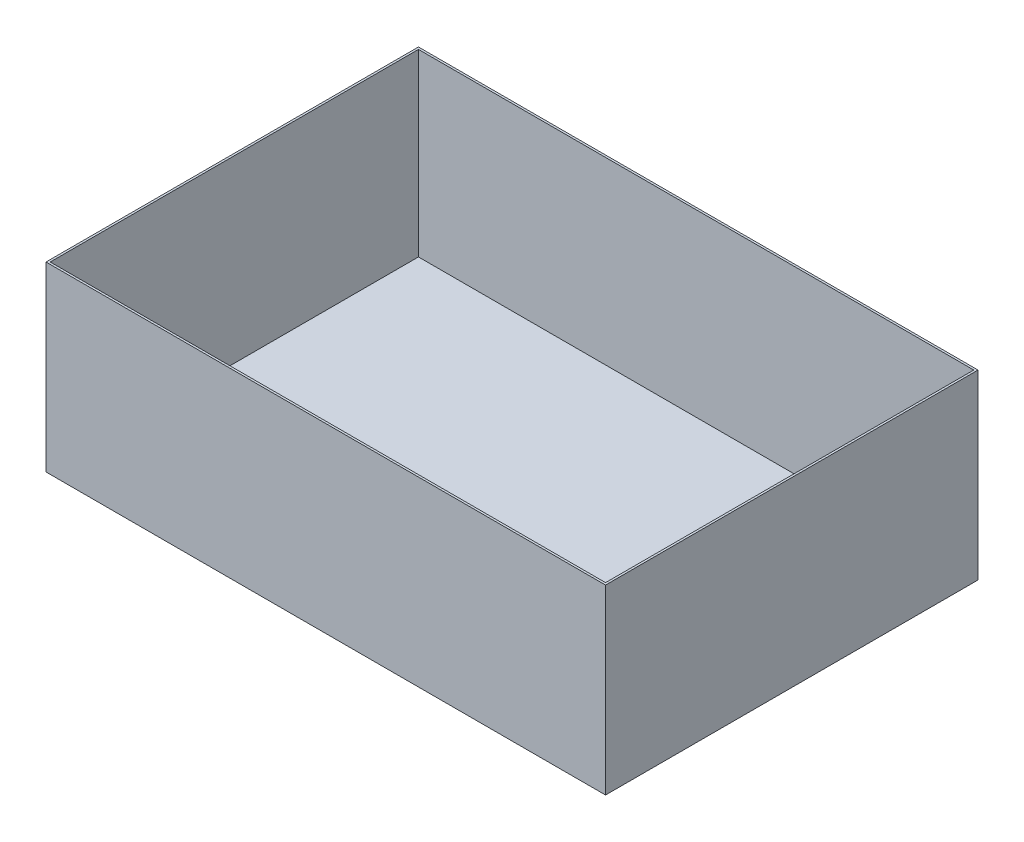
ISO-10303-21;
HEADER;
FILE_DESCRIPTION(('STEP AP214'),'2;1');
FILE_NAME('part.step','',(''),(''),'','','');
FILE_SCHEMA(('AUTOMOTIVE_DESIGN { 1 0 10303 214 1 1 1 1 }'));
ENDSEC;
DATA;
#1=APPLICATION_CONTEXT('core data for automotive mechanical design processes');
#2=APPLICATION_PROTOCOL_DEFINITION('international standard','automotive_design',2000,#1);
#3=PRODUCT_CONTEXT('',#1,'mechanical');
#4=PRODUCT('Part','Part','',(#3));
#5=PRODUCT_RELATED_PRODUCT_CATEGORY('part','',(#4));
#6=PRODUCT_DEFINITION_FORMATION('','',#4);
#7=PRODUCT_DEFINITION_CONTEXT('part definition',#1,'design');
#8=PRODUCT_DEFINITION('design','',#6,#7);
#9=PRODUCT_DEFINITION_SHAPE('','',#8);
#10=(LENGTH_UNIT() NAMED_UNIT(*) SI_UNIT(.MILLI.,.METRE.));
#11=(NAMED_UNIT(*) PLANE_ANGLE_UNIT() SI_UNIT($,.RADIAN.));
#12=(NAMED_UNIT(*) SI_UNIT($,.STERADIAN.) SOLID_ANGLE_UNIT());
#13=UNCERTAINTY_MEASURE_WITH_UNIT(LENGTH_MEASURE(1.E-05),#10,'distance_accuracy_value','');
#14=(GEOMETRIC_REPRESENTATION_CONTEXT(3) GLOBAL_UNCERTAINTY_ASSIGNED_CONTEXT((#13)) GLOBAL_UNIT_ASSIGNED_CONTEXT((#10,
#11,#12)) REPRESENTATION_CONTEXT('',''));
#15=CARTESIAN_POINT('',(0.,0.,0.));
#16=DIRECTION('',(0.,0.,1.));
#17=DIRECTION('',(1.,0.,0.));
#18=AXIS2_PLACEMENT_3D('',#15,#16,#17);
#19=CARTESIAN_POINT('',(0.,195.,0.));
#20=DIRECTION('',(0.,-1.,0.));
#21=DIRECTION('',(0.,0.,-1.));
#22=AXIS2_PLACEMENT_3D('',#19,#20,#21);
#23=PLANE('',#22);
#24=DIRECTION('',(0.,0.,1.));
#25=VECTOR('',#24,1.);
#26=CARTESIAN_POINT('',(0.,195.,0.));
#27=LINE('',#26,#25);
#28=CARTESIAN_POINT('',(0.,195.,-399.38));
#29=VERTEX_POINT('',#28);
#30=CARTESIAN_POINT('',(0.,195.,0.));
#31=VERTEX_POINT('',#30);
#32=EDGE_CURVE('E145',#29,#31,#27,.T.);
#33=ORIENTED_EDGE('',*,*,#32,.T.);
#34=DIRECTION('',(1.,0.,0.));
#35=VECTOR('',#34,1.);
#36=CARTESIAN_POINT('',(0.,195.,0.));
#37=LINE('',#36,#35);
#38=CARTESIAN_POINT('',(600.,195.,0.));
#39=VERTEX_POINT('',#38);
#40=EDGE_CURVE('E89',#31,#39,#37,.T.);
#41=ORIENTED_EDGE('',*,*,#40,.T.);
#42=DIRECTION('',(0.,0.,-1.));
#43=VECTOR('',#42,1.);
#44=CARTESIAN_POINT('',(600.,195.,0.));
#45=LINE('',#44,#43);
#46=CARTESIAN_POINT('',(600.,195.,-399.38));
#47=VERTEX_POINT('',#46);
#48=EDGE_CURVE('E148',#39,#47,#45,.T.);
#49=ORIENTED_EDGE('',*,*,#48,.T.);
#50=DIRECTION('',(-1.,0.,0.));
#51=VECTOR('',#50,1.);
#52=CARTESIAN_POINT('',(0.,195.,-399.38));
#53=LINE('',#52,#51);
#54=EDGE_CURVE('E61',#47,#29,#53,.T.);
#55=ORIENTED_EDGE('',*,*,#54,.T.);
#56=EDGE_LOOP('',(#33,#41,#49,#55));
#57=FACE_BOUND('',#56,.T.);
#58=DIRECTION('',(0.,0.,1.));
#59=VECTOR('',#58,1.);
#60=CARTESIAN_POINT('',(2.25,195.,0.));
#61=LINE('',#60,#59);
#62=CARTESIAN_POINT('',(2.25,195.,-397.13));
#63=VERTEX_POINT('',#62);
#64=CARTESIAN_POINT('',(2.25,195.,-2.25));
#65=VERTEX_POINT('',#64);
#66=EDGE_CURVE('E134',#63,#65,#61,.T.);
#67=ORIENTED_EDGE('',*,*,#66,.F.);
#68=DIRECTION('',(-1.,0.,0.));
#69=VECTOR('',#68,1.);
#70=CARTESIAN_POINT('',(0.,195.,-397.13));
#71=LINE('',#70,#69);
#72=CARTESIAN_POINT('',(597.75,195.,-397.13));
#73=VERTEX_POINT('',#72);
#74=EDGE_CURVE('E143',#73,#63,#71,.T.);
#75=ORIENTED_EDGE('',*,*,#74,.F.);
#76=DIRECTION('',(0.,0.,-1.));
#77=VECTOR('',#76,1.);
#78=CARTESIAN_POINT('',(597.75,195.,0.));
#79=LINE('',#78,#77);
#80=CARTESIAN_POINT('',(597.75,195.,-2.25));
#81=VERTEX_POINT('',#80);
#82=EDGE_CURVE('E141',#81,#73,#79,.T.);
#83=ORIENTED_EDGE('',*,*,#82,.F.);
#84=DIRECTION('',(1.,0.,0.));
#85=VECTOR('',#84,1.);
#86=CARTESIAN_POINT('',(0.,195.,-2.25));
#87=LINE('',#86,#85);
#88=EDGE_CURVE('E126',#65,#81,#87,.T.);
#89=ORIENTED_EDGE('',*,*,#88,.F.);
#90=EDGE_LOOP('',(#67,#75,#83,#89));
#91=FACE_BOUND('',#90,.T.);
#92=ADVANCED_FACE('F37',(#57,#91),#23,.F.);
#93=CARTESIAN_POINT('',(0.,195.,0.));
#94=DIRECTION('',(1.,0.,0.));
#95=DIRECTION('',(0.,0.,-1.));
#96=AXIS2_PLACEMENT_3D('',#93,#94,#95);
#97=PLANE('',#96);
#98=DIRECTION('',(0.,0.,1.));
#99=VECTOR('',#98,1.);
#100=CARTESIAN_POINT('',(0.,0.,0.));
#101=LINE('',#100,#99);
#102=CARTESIAN_POINT('',(0.,0.,-399.38));
#103=VERTEX_POINT('',#102);
#104=CARTESIAN_POINT('',(0.,0.,0.));
#105=VERTEX_POINT('',#104);
#106=EDGE_CURVE('E152',#103,#105,#101,.T.);
#107=ORIENTED_EDGE('',*,*,#106,.T.);
#108=DIRECTION('',(0.,-1.,0.));
#109=VECTOR('',#108,1.);
#110=CARTESIAN_POINT('',(0.,195.,0.));
#111=LINE('',#110,#109);
#112=EDGE_CURVE('E11',#31,#105,#111,.T.);
#113=ORIENTED_EDGE('',*,*,#112,.F.);
#114=ORIENTED_EDGE('',*,*,#32,.F.);
#115=DIRECTION('',(0.,-1.,0.));
#116=VECTOR('',#115,1.);
#117=CARTESIAN_POINT('',(0.,195.,-399.38));
#118=LINE('',#117,#116);
#119=EDGE_CURVE('E151',#29,#103,#118,.T.);
#120=ORIENTED_EDGE('',*,*,#119,.T.);
#121=EDGE_LOOP('',(#107,#113,#114,#120));
#122=FACE_BOUND('',#121,.T.);
#123=ADVANCED_FACE('F39',(#122),#97,.F.);
#124=CARTESIAN_POINT('',(0.,195.,0.));
#125=DIRECTION('',(0.,0.,-1.));
#126=DIRECTION('',(-1.,0.,0.));
#127=AXIS2_PLACEMENT_3D('',#124,#125,#126);
#128=PLANE('',#127);
#129=DIRECTION('',(1.,0.,0.));
#130=VECTOR('',#129,1.);
#131=CARTESIAN_POINT('',(0.,0.,0.));
#132=LINE('',#131,#130);
#133=CARTESIAN_POINT('',(600.,0.,0.));
#134=VERTEX_POINT('',#133);
#135=EDGE_CURVE('E155',#105,#134,#132,.T.);
#136=ORIENTED_EDGE('',*,*,#135,.T.);
#137=DIRECTION('',(0.,-1.,0.));
#138=VECTOR('',#137,1.);
#139=CARTESIAN_POINT('',(600.,195.,0.));
#140=LINE('',#139,#138);
#141=EDGE_CURVE('E45',#39,#134,#140,.T.);
#142=ORIENTED_EDGE('',*,*,#141,.F.);
#143=ORIENTED_EDGE('',*,*,#40,.F.);
#144=ORIENTED_EDGE('',*,*,#112,.T.);
#145=EDGE_LOOP('',(#136,#142,#143,#144));
#146=FACE_BOUND('',#145,.T.);
#147=ADVANCED_FACE('F183',(#146),#128,.F.);
#148=CARTESIAN_POINT('',(600.,195.,0.));
#149=DIRECTION('',(-1.,0.,0.));
#150=DIRECTION('',(0.,0.,1.));
#151=AXIS2_PLACEMENT_3D('',#148,#149,#150);
#152=PLANE('',#151);
#153=DIRECTION('',(0.,0.,-1.));
#154=VECTOR('',#153,1.);
#155=CARTESIAN_POINT('',(600.,0.,0.));
#156=LINE('',#155,#154);
#157=CARTESIAN_POINT('',(600.,0.,-399.38));
#158=VERTEX_POINT('',#157);
#159=EDGE_CURVE('E157',#134,#158,#156,.T.);
#160=ORIENTED_EDGE('',*,*,#159,.T.);
#161=DIRECTION('',(0.,-1.,0.));
#162=VECTOR('',#161,1.);
#163=CARTESIAN_POINT('',(600.,195.,-399.38));
#164=LINE('',#163,#162);
#165=EDGE_CURVE('E161',#47,#158,#164,.T.);
#166=ORIENTED_EDGE('',*,*,#165,.F.);
#167=ORIENTED_EDGE('',*,*,#48,.F.);
#168=ORIENTED_EDGE('',*,*,#141,.T.);
#169=EDGE_LOOP('',(#160,#166,#167,#168));
#170=FACE_BOUND('',#169,.T.);
#171=ADVANCED_FACE('F166',(#170),#152,.F.);
#172=CARTESIAN_POINT('',(0.,195.,-399.38));
#173=DIRECTION('',(0.,0.,1.));
#174=DIRECTION('',(1.,0.,0.));
#175=AXIS2_PLACEMENT_3D('',#172,#173,#174);
#176=PLANE('',#175);
#177=DIRECTION('',(-1.,0.,0.));
#178=VECTOR('',#177,1.);
#179=CARTESIAN_POINT('',(0.,0.,-399.38));
#180=LINE('',#179,#178);
#181=EDGE_CURVE('E82',#158,#103,#180,.T.);
#182=ORIENTED_EDGE('',*,*,#181,.T.);
#183=ORIENTED_EDGE('',*,*,#119,.F.);
#184=ORIENTED_EDGE('',*,*,#54,.F.);
#185=ORIENTED_EDGE('',*,*,#165,.T.);
#186=EDGE_LOOP('',(#182,#183,#184,#185));
#187=FACE_BOUND('',#186,.T.);
#188=ADVANCED_FACE('F174',(#187),#176,.F.);
#189=CARTESIAN_POINT('',(0.,0.,0.));
#190=DIRECTION('',(0.,-1.,0.));
#191=DIRECTION('',(0.,0.,-1.));
#192=AXIS2_PLACEMENT_3D('',#189,#190,#191);
#193=PLANE('',#192);
#194=ORIENTED_EDGE('',*,*,#106,.F.);
#195=ORIENTED_EDGE('',*,*,#181,.F.);
#196=ORIENTED_EDGE('',*,*,#159,.F.);
#197=ORIENTED_EDGE('',*,*,#135,.F.);
#198=EDGE_LOOP('',(#194,#195,#196,#197));
#199=FACE_BOUND('',#198,.T.);
#200=ADVANCED_FACE('F170',(#199),#193,.T.);
#201=CARTESIAN_POINT('',(2.25,195.,0.));
#202=DIRECTION('',(1.,0.,0.));
#203=DIRECTION('',(0.,0.,-1.));
#204=AXIS2_PLACEMENT_3D('',#201,#202,#203);
#205=PLANE('',#204);
#206=DIRECTION('',(0.,0.,1.));
#207=VECTOR('',#206,1.);
#208=CARTESIAN_POINT('',(2.25,2.25,0.));
#209=LINE('',#208,#207);
#210=CARTESIAN_POINT('',(2.25,2.25,-397.13));
#211=VERTEX_POINT('',#210);
#212=CARTESIAN_POINT('',(2.25,2.25,-2.25));
#213=VERTEX_POINT('',#212);
#214=EDGE_CURVE('E117',#211,#213,#209,.T.);
#215=ORIENTED_EDGE('',*,*,#214,.F.);
#216=DIRECTION('',(0.,-1.,0.));
#217=VECTOR('',#216,1.);
#218=CARTESIAN_POINT('',(2.25,195.,-397.13));
#219=LINE('',#218,#217);
#220=EDGE_CURVE('E137',#63,#211,#219,.T.);
#221=ORIENTED_EDGE('',*,*,#220,.F.);
#222=ORIENTED_EDGE('',*,*,#66,.T.);
#223=DIRECTION('',(0.,-1.,0.));
#224=VECTOR('',#223,1.);
#225=CARTESIAN_POINT('',(2.25,195.,-2.25));
#226=LINE('',#225,#224);
#227=EDGE_CURVE('E129',#65,#213,#226,.T.);
#228=ORIENTED_EDGE('',*,*,#227,.T.);
#229=EDGE_LOOP('',(#215,#221,#222,#228));
#230=FACE_BOUND('',#229,.T.);
#231=ADVANCED_FACE('F181',(#230),#205,.T.);
#232=CARTESIAN_POINT('',(0.,195.,-2.25));
#233=DIRECTION('',(0.,0.,-1.));
#234=DIRECTION('',(-1.,0.,0.));
#235=AXIS2_PLACEMENT_3D('',#232,#233,#234);
#236=PLANE('',#235);
#237=DIRECTION('',(1.,0.,0.));
#238=VECTOR('',#237,1.);
#239=CARTESIAN_POINT('',(0.,2.25,-2.25));
#240=LINE('',#239,#238);
#241=CARTESIAN_POINT('',(597.75,2.25,-2.25));
#242=VERTEX_POINT('',#241);
#243=EDGE_CURVE('E111',#213,#242,#240,.T.);
#244=ORIENTED_EDGE('',*,*,#243,.F.);
#245=ORIENTED_EDGE('',*,*,#227,.F.);
#246=ORIENTED_EDGE('',*,*,#88,.T.);
#247=DIRECTION('',(0.,-1.,0.));
#248=VECTOR('',#247,1.);
#249=CARTESIAN_POINT('',(597.75,195.,-2.25));
#250=LINE('',#249,#248);
#251=EDGE_CURVE('E123',#81,#242,#250,.T.);
#252=ORIENTED_EDGE('',*,*,#251,.T.);
#253=EDGE_LOOP('',(#244,#245,#246,#252));
#254=FACE_BOUND('',#253,.T.);
#255=ADVANCED_FACE('F124',(#254),#236,.T.);
#256=CARTESIAN_POINT('',(597.75,195.,0.));
#257=DIRECTION('',(-1.,0.,0.));
#258=DIRECTION('',(0.,0.,1.));
#259=AXIS2_PLACEMENT_3D('',#256,#257,#258);
#260=PLANE('',#259);
#261=DIRECTION('',(0.,0.,-1.));
#262=VECTOR('',#261,1.);
#263=CARTESIAN_POINT('',(597.75,2.25,0.));
#264=LINE('',#263,#262);
#265=CARTESIAN_POINT('',(597.75,2.25,-397.13));
#266=VERTEX_POINT('',#265);
#267=EDGE_CURVE('E115',#242,#266,#264,.T.);
#268=ORIENTED_EDGE('',*,*,#267,.F.);
#269=ORIENTED_EDGE('',*,*,#251,.F.);
#270=ORIENTED_EDGE('',*,*,#82,.T.);
#271=DIRECTION('',(0.,-1.,0.));
#272=VECTOR('',#271,1.);
#273=CARTESIAN_POINT('',(597.75,195.,-397.13));
#274=LINE('',#273,#272);
#275=EDGE_CURVE('E52',#73,#266,#274,.T.);
#276=ORIENTED_EDGE('',*,*,#275,.T.);
#277=EDGE_LOOP('',(#268,#269,#270,#276));
#278=FACE_BOUND('',#277,.T.);
#279=ADVANCED_FACE('F131',(#278),#260,.T.);
#280=CARTESIAN_POINT('',(0.,195.,-397.13));
#281=DIRECTION('',(0.,0.,1.));
#282=DIRECTION('',(1.,0.,0.));
#283=AXIS2_PLACEMENT_3D('',#280,#281,#282);
#284=PLANE('',#283);
#285=DIRECTION('',(-1.,0.,0.));
#286=VECTOR('',#285,1.);
#287=CARTESIAN_POINT('',(0.,2.25,-397.13));
#288=LINE('',#287,#286);
#289=EDGE_CURVE('E132',#266,#211,#288,.T.);
#290=ORIENTED_EDGE('',*,*,#289,.F.);
#291=ORIENTED_EDGE('',*,*,#275,.F.);
#292=ORIENTED_EDGE('',*,*,#74,.T.);
#293=ORIENTED_EDGE('',*,*,#220,.T.);
#294=EDGE_LOOP('',(#290,#291,#292,#293));
#295=FACE_BOUND('',#294,.T.);
#296=ADVANCED_FACE('F194',(#295),#284,.T.);
#297=CARTESIAN_POINT('',(0.,2.25,0.));
#298=DIRECTION('',(0.,-1.,0.));
#299=DIRECTION('',(0.,0.,-1.));
#300=AXIS2_PLACEMENT_3D('',#297,#298,#299);
#301=PLANE('',#300);
#302=ORIENTED_EDGE('',*,*,#214,.T.);
#303=ORIENTED_EDGE('',*,*,#243,.T.);
#304=ORIENTED_EDGE('',*,*,#267,.T.);
#305=ORIENTED_EDGE('',*,*,#289,.T.);
#306=EDGE_LOOP('',(#302,#303,#304,#305));
#307=FACE_BOUND('',#306,.T.);
#308=ADVANCED_FACE('F113',(#307),#301,.F.);
#309=CLOSED_SHELL('',(#92,#123,#147,#171,#188,#200,#231,#255,#279,#296,#308));
#310=MANIFOLD_SOLID_BREP('B2',#309);
#311=ADVANCED_BREP_SHAPE_REPRESENTATION('',(#18,#310),#14);
#312=SHAPE_DEFINITION_REPRESENTATION(#9,#311);
ENDSEC;
END-ISO-10303-21;
